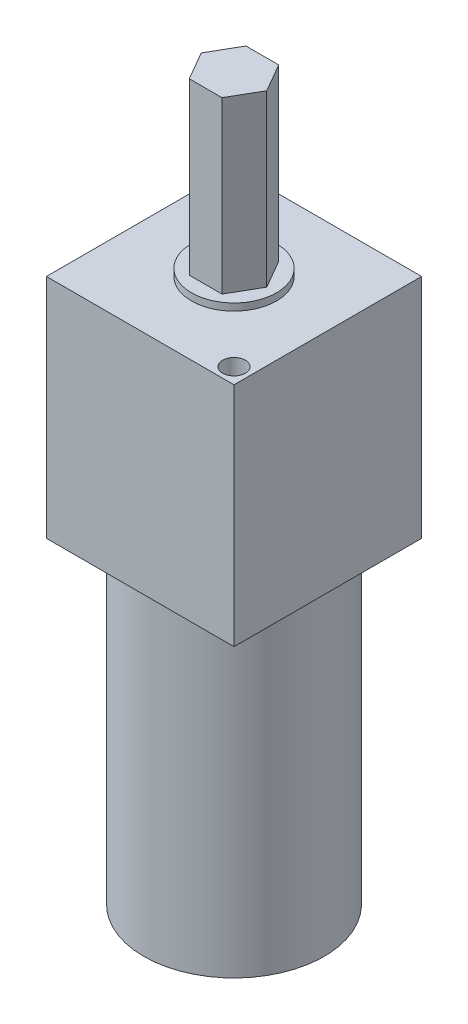
ISO-10303-21;
HEADER;
FILE_DESCRIPTION(('STEP AP214'),'2;1');
FILE_NAME('part.step','',(''),(''),'','','');
FILE_SCHEMA(('AUTOMOTIVE_DESIGN { 1 0 10303 214 1 1 1 1 }'));
ENDSEC;
DATA;
#1=APPLICATION_CONTEXT('core data for automotive mechanical design processes');
#2=APPLICATION_PROTOCOL_DEFINITION('international standard','automotive_design',2000,#1);
#3=PRODUCT_CONTEXT('',#1,'mechanical');
#4=PRODUCT('Part','Part','',(#3));
#5=PRODUCT_RELATED_PRODUCT_CATEGORY('part','',(#4));
#6=PRODUCT_DEFINITION_FORMATION('','',#4);
#7=PRODUCT_DEFINITION_CONTEXT('part definition',#1,'design');
#8=PRODUCT_DEFINITION('design','',#6,#7);
#9=PRODUCT_DEFINITION_SHAPE('','',#8);
#10=(LENGTH_UNIT() NAMED_UNIT(*) SI_UNIT(.MILLI.,.METRE.));
#11=(NAMED_UNIT(*) PLANE_ANGLE_UNIT() SI_UNIT($,.RADIAN.));
#12=(NAMED_UNIT(*) SI_UNIT($,.STERADIAN.) SOLID_ANGLE_UNIT());
#13=UNCERTAINTY_MEASURE_WITH_UNIT(LENGTH_MEASURE(1.E-05),#10,'distance_accuracy_value','');
#14=(GEOMETRIC_REPRESENTATION_CONTEXT(3) GLOBAL_UNCERTAINTY_ASSIGNED_CONTEXT((#13)) GLOBAL_UNIT_ASSIGNED_CONTEXT((#10,
#11,#12)) REPRESENTATION_CONTEXT('',''));
#15=CARTESIAN_POINT('',(0.,0.,0.));
#16=DIRECTION('',(0.,0.,1.));
#17=DIRECTION('',(1.,0.,0.));
#18=AXIS2_PLACEMENT_3D('',#15,#16,#17);
#19=CARTESIAN_POINT('',(0.,52.3875,0.));
#20=DIRECTION('',(0.,1.,0.));
#21=DIRECTION('',(0.,0.,1.));
#22=AXIS2_PLACEMENT_3D('',#19,#20,#21);
#23=PLANE('',#22);
#24=CARTESIAN_POINT('',(0.,52.3875,0.));
#25=DIRECTION('',(0.,1.,0.));
#26=DIRECTION('',(0.,0.,1.));
#27=AXIS2_PLACEMENT_3D('',#24,#25,#26);
#28=CIRCLE('',#27,9.525);
#29=CARTESIAN_POINT('',(0.,52.3875,9.525));
#30=VERTEX_POINT('',#29);
#31=EDGE_CURVE('E152',#30,#30,#28,.T.);
#32=ORIENTED_EDGE('',*,*,#31,.T.);
#33=EDGE_LOOP('',(#32));
#34=FACE_BOUND('',#33,.T.);
#35=DIRECTION('',(0.5,0.,-0.866025403784439));
#36=VECTOR('',#35,1.);
#37=CARTESIAN_POINT('',(3.66617420935412,52.3875,6.35));
#38=LINE('',#37,#36);
#39=CARTESIAN_POINT('',(3.66617420935412,52.3875,6.35));
#40=VERTEX_POINT('',#39);
#41=CARTESIAN_POINT('',(7.33234841870825,52.3875,0.));
#42=VERTEX_POINT('',#41);
#43=EDGE_CURVE('E405',#40,#42,#38,.T.);
#44=ORIENTED_EDGE('',*,*,#43,.F.);
#45=DIRECTION('',(1.,0.,0.));
#46=VECTOR('',#45,1.);
#47=CARTESIAN_POINT('',(-3.66617420935412,52.3875,6.35));
#48=LINE('',#47,#46);
#49=CARTESIAN_POINT('',(-3.66617420935412,52.3875,6.35));
#50=VERTEX_POINT('',#49);
#51=EDGE_CURVE('E147',#50,#40,#48,.T.);
#52=ORIENTED_EDGE('',*,*,#51,.F.);
#53=DIRECTION('',(0.5,0.,0.866025403784439));
#54=VECTOR('',#53,1.);
#55=CARTESIAN_POINT('',(-7.33234841870825,52.3875,0.));
#56=LINE('',#55,#54);
#57=CARTESIAN_POINT('',(-7.33234841870825,52.3875,0.));
#58=VERTEX_POINT('',#57);
#59=EDGE_CURVE('E143',#58,#50,#56,.T.);
#60=ORIENTED_EDGE('',*,*,#59,.F.);
#61=DIRECTION('',(-0.5,0.,0.866025403784438));
#62=VECTOR('',#61,1.);
#63=CARTESIAN_POINT('',(-3.66617420935413,52.3875,-6.35));
#64=LINE('',#63,#62);
#65=CARTESIAN_POINT('',(-3.66617420935413,52.3875,-6.35));
#66=VERTEX_POINT('',#65);
#67=EDGE_CURVE('E420',#66,#58,#64,.T.);
#68=ORIENTED_EDGE('',*,*,#67,.F.);
#69=DIRECTION('',(-1.,0.,0.));
#70=VECTOR('',#69,1.);
#71=CARTESIAN_POINT('',(3.66617420935412,52.3875,-6.35));
#72=LINE('',#71,#70);
#73=CARTESIAN_POINT('',(3.66617420935412,52.3875,-6.35));
#74=VERTEX_POINT('',#73);
#75=EDGE_CURVE('E418',#74,#66,#72,.T.);
#76=ORIENTED_EDGE('',*,*,#75,.F.);
#77=DIRECTION('',(-0.5,0.,-0.866025403784439));
#78=VECTOR('',#77,1.);
#79=CARTESIAN_POINT('',(7.33234841870825,52.3875,0.));
#80=LINE('',#79,#78);
#81=EDGE_CURVE('E416',#42,#74,#80,.T.);
#82=ORIENTED_EDGE('',*,*,#81,.F.);
#83=EDGE_LOOP('',(#44,#52,#60,#68,#76,#82));
#84=FACE_BOUND('',#83,.T.);
#85=ADVANCED_FACE('F37',(#34,#84),#23,.T.);
#86=CARTESIAN_POINT('',(0.,50.8,0.));
#87=DIRECTION('',(0.,1.,0.));
#88=DIRECTION('',(0.,0.,1.));
#89=AXIS2_PLACEMENT_3D('',#86,#87,#88);
#90=PLANE('',#89);
#91=CARTESIAN_POINT('',(0.,50.8,0.));
#92=DIRECTION('',(0.,1.,0.));
#93=DIRECTION('',(0.,0.,1.));
#94=AXIS2_PLACEMENT_3D('',#91,#92,#93);
#95=CIRCLE('',#94,9.525);
#96=CARTESIAN_POINT('',(0.,50.8,9.525));
#97=VERTEX_POINT('',#96);
#98=EDGE_CURVE('E149',#97,#97,#95,.T.);
#99=ORIENTED_EDGE('',*,*,#98,.F.);
#100=EDGE_LOOP('',(#99));
#101=FACE_BOUND('',#100,.T.);
#102=CARTESIAN_POINT('',(-17.5025191799638,50.8,-17.5025191799638));
#103=DIRECTION('',(0.,1.,0.));
#104=DIRECTION('',(0.,0.,1.));
#105=AXIS2_PLACEMENT_3D('',#102,#103,#104);
#106=CIRCLE('',#105,2.54);
#107=CARTESIAN_POINT('',(-17.5025191799638,50.8,-14.9625191799638));
#108=VERTEX_POINT('',#107);
#109=EDGE_CURVE('E167',#108,#108,#106,.T.);
#110=ORIENTED_EDGE('',*,*,#109,.F.);
#111=EDGE_LOOP('',(#110));
#112=FACE_BOUND('',#111,.T.);
#113=DIRECTION('',(0.,0.,-1.));
#114=VECTOR('',#113,1.);
#115=CARTESIAN_POINT('',(21.0058,50.8,-21.0058));
#116=LINE('',#115,#114);
#117=CARTESIAN_POINT('',(21.0058,50.8,21.0058));
#118=VERTEX_POINT('',#117);
#119=CARTESIAN_POINT('',(21.0058,50.8,-21.0058));
#120=VERTEX_POINT('',#119);
#121=EDGE_CURVE('E173',#118,#120,#116,.T.);
#122=ORIENTED_EDGE('',*,*,#121,.T.);
#123=DIRECTION('',(-1.,0.,0.));
#124=VECTOR('',#123,1.);
#125=CARTESIAN_POINT('',(-21.0058,50.8,-21.0058));
#126=LINE('',#125,#124);
#127=CARTESIAN_POINT('',(-21.0058,50.8,-21.0058));
#128=VERTEX_POINT('',#127);
#129=EDGE_CURVE('E90',#120,#128,#126,.T.);
#130=ORIENTED_EDGE('',*,*,#129,.T.);
#131=DIRECTION('',(0.,0.,1.));
#132=VECTOR('',#131,1.);
#133=CARTESIAN_POINT('',(-21.0058,50.8,-21.0058));
#134=LINE('',#133,#132);
#135=CARTESIAN_POINT('',(-21.0058,50.8,21.0058));
#136=VERTEX_POINT('',#135);
#137=EDGE_CURVE('E176',#128,#136,#134,.T.);
#138=ORIENTED_EDGE('',*,*,#137,.T.);
#139=DIRECTION('',(1.,0.,0.));
#140=VECTOR('',#139,1.);
#141=CARTESIAN_POINT('',(-21.0058,50.8,21.0058));
#142=LINE('',#141,#140);
#143=EDGE_CURVE('E61',#136,#118,#142,.T.);
#144=ORIENTED_EDGE('',*,*,#143,.T.);
#145=EDGE_LOOP('',(#122,#130,#138,#144));
#146=FACE_BOUND('',#145,.T.);
#147=CARTESIAN_POINT('',(17.5025191799638,50.8,17.5025191799638));
#148=DIRECTION('',(0.,1.,0.));
#149=DIRECTION('',(0.,0.,1.));
#150=AXIS2_PLACEMENT_3D('',#147,#148,#149);
#151=CIRCLE('',#150,2.54);
#152=CARTESIAN_POINT('',(17.5025191799638,50.8,20.0425191799638));
#153=VERTEX_POINT('',#152);
#154=EDGE_CURVE('E161',#153,#153,#151,.T.);
#155=ORIENTED_EDGE('',*,*,#154,.F.);
#156=EDGE_LOOP('',(#155));
#157=FACE_BOUND('',#156,.T.);
#158=ADVANCED_FACE('F206',(#101,#112,#146,#157),#90,.T.);
#159=CARTESIAN_POINT('',(0.,0.,0.));
#160=DIRECTION('',(0.,1.,0.));
#161=DIRECTION('',(0.,0.,1.));
#162=AXIS2_PLACEMENT_3D('',#159,#160,#161);
#163=PLANE('',#162);
#164=CARTESIAN_POINT('',(0.,0.,0.));
#165=DIRECTION('',(0.,1.,0.));
#166=DIRECTION('',(0.,0.,1.));
#167=AXIS2_PLACEMENT_3D('',#164,#165,#166);
#168=CIRCLE('',#167,20.193);
#169=CARTESIAN_POINT('',(0.,0.,20.193));
#170=VERTEX_POINT('',#169);
#171=EDGE_CURVE('E11',#170,#170,#168,.F.);
#172=ORIENTED_EDGE('',*,*,#171,.F.);
#173=EDGE_LOOP('',(#172));
#174=FACE_BOUND('',#173,.T.);
#175=DIRECTION('',(0.,0.,-1.));
#176=VECTOR('',#175,1.);
#177=CARTESIAN_POINT('',(21.0058,0.,-21.0058));
#178=LINE('',#177,#176);
#179=CARTESIAN_POINT('',(21.0058,0.,21.0058));
#180=VERTEX_POINT('',#179);
#181=CARTESIAN_POINT('',(21.0058,0.,-21.0058));
#182=VERTEX_POINT('',#181);
#183=EDGE_CURVE('E170',#180,#182,#178,.T.);
#184=ORIENTED_EDGE('',*,*,#183,.F.);
#185=DIRECTION('',(1.,0.,0.));
#186=VECTOR('',#185,1.);
#187=CARTESIAN_POINT('',(-21.0058,0.,21.0058));
#188=LINE('',#187,#186);
#189=CARTESIAN_POINT('',(-21.0058,0.,21.0058));
#190=VERTEX_POINT('',#189);
#191=EDGE_CURVE('E82',#190,#180,#188,.T.);
#192=ORIENTED_EDGE('',*,*,#191,.F.);
#193=DIRECTION('',(0.,0.,1.));
#194=VECTOR('',#193,1.);
#195=CARTESIAN_POINT('',(-21.0058,0.,-21.0058));
#196=LINE('',#195,#194);
#197=CARTESIAN_POINT('',(-21.0058,0.,-21.0058));
#198=VERTEX_POINT('',#197);
#199=EDGE_CURVE('E184',#198,#190,#196,.T.);
#200=ORIENTED_EDGE('',*,*,#199,.F.);
#201=DIRECTION('',(-1.,0.,0.));
#202=VECTOR('',#201,1.);
#203=CARTESIAN_POINT('',(-21.0058,0.,-21.0058));
#204=LINE('',#203,#202);
#205=EDGE_CURVE('E182',#182,#198,#204,.T.);
#206=ORIENTED_EDGE('',*,*,#205,.F.);
#207=EDGE_LOOP('',(#184,#192,#200,#206));
#208=FACE_BOUND('',#207,.T.);
#209=CARTESIAN_POINT('',(-17.5025191799638,0.,-17.5025191799638));
#210=DIRECTION('',(0.,1.,0.));
#211=DIRECTION('',(0.,0.,1.));
#212=AXIS2_PLACEMENT_3D('',#209,#210,#211);
#213=CIRCLE('',#212,2.54);
#214=CARTESIAN_POINT('',(-17.5025191799638,0.,-14.9625191799638));
#215=VERTEX_POINT('',#214);
#216=EDGE_CURVE('E164',#215,#215,#213,.T.);
#217=ORIENTED_EDGE('',*,*,#216,.T.);
#218=EDGE_LOOP('',(#217));
#219=FACE_BOUND('',#218,.T.);
#220=CARTESIAN_POINT('',(17.5025191799638,0.,17.5025191799638));
#221=DIRECTION('',(0.,1.,0.));
#222=DIRECTION('',(0.,0.,1.));
#223=AXIS2_PLACEMENT_3D('',#220,#221,#222);
#224=CIRCLE('',#223,2.54);
#225=CARTESIAN_POINT('',(17.5025191799638,0.,20.0425191799638));
#226=VERTEX_POINT('',#225);
#227=EDGE_CURVE('E159',#226,#226,#224,.T.);
#228=ORIENTED_EDGE('',*,*,#227,.T.);
#229=EDGE_LOOP('',(#228));
#230=FACE_BOUND('',#229,.T.);
#231=ADVANCED_FACE('F198',(#174,#208,#219,#230),#163,.F.);
#232=CARTESIAN_POINT('',(21.0058,50.8,-21.0058));
#233=DIRECTION('',(-1.,0.,0.));
#234=DIRECTION('',(0.,0.,1.));
#235=AXIS2_PLACEMENT_3D('',#232,#233,#234);
#236=PLANE('',#235);
#237=ORIENTED_EDGE('',*,*,#183,.T.);
#238=DIRECTION('',(0.,-1.,0.));
#239=VECTOR('',#238,1.);
#240=CARTESIAN_POINT('',(21.0058,50.8,-21.0058));
#241=LINE('',#240,#239);
#242=EDGE_CURVE('E45',#120,#182,#241,.T.);
#243=ORIENTED_EDGE('',*,*,#242,.F.);
#244=ORIENTED_EDGE('',*,*,#121,.F.);
#245=DIRECTION('',(0.,-1.,0.));
#246=VECTOR('',#245,1.);
#247=CARTESIAN_POINT('',(21.0058,50.8,21.0058));
#248=LINE('',#247,#246);
#249=EDGE_CURVE('E179',#118,#180,#248,.T.);
#250=ORIENTED_EDGE('',*,*,#249,.T.);
#251=EDGE_LOOP('',(#237,#243,#244,#250));
#252=FACE_BOUND('',#251,.T.);
#253=ADVANCED_FACE('F39',(#252),#236,.F.);
#254=CARTESIAN_POINT('',(-21.0058,50.8,-21.0058));
#255=DIRECTION('',(0.,0.,1.));
#256=DIRECTION('',(1.,0.,0.));
#257=AXIS2_PLACEMENT_3D('',#254,#255,#256);
#258=PLANE('',#257);
#259=ORIENTED_EDGE('',*,*,#205,.T.);
#260=DIRECTION('',(0.,-1.,0.));
#261=VECTOR('',#260,1.);
#262=CARTESIAN_POINT('',(-21.0058,50.8,-21.0058));
#263=LINE('',#262,#261);
#264=EDGE_CURVE('E190',#128,#198,#263,.T.);
#265=ORIENTED_EDGE('',*,*,#264,.F.);
#266=ORIENTED_EDGE('',*,*,#129,.F.);
#267=ORIENTED_EDGE('',*,*,#242,.T.);
#268=EDGE_LOOP('',(#259,#265,#266,#267));
#269=FACE_BOUND('',#268,.T.);
#270=ADVANCED_FACE('F193',(#269),#258,.F.);
#271=CARTESIAN_POINT('',(-21.0058,50.8,-21.0058));
#272=DIRECTION('',(1.,0.,0.));
#273=DIRECTION('',(0.,0.,-1.));
#274=AXIS2_PLACEMENT_3D('',#271,#272,#273);
#275=PLANE('',#274);
#276=ORIENTED_EDGE('',*,*,#199,.T.);
#277=DIRECTION('',(0.,-1.,0.));
#278=VECTOR('',#277,1.);
#279=CARTESIAN_POINT('',(-21.0058,50.8,21.0058));
#280=LINE('',#279,#278);
#281=EDGE_CURVE('E188',#136,#190,#280,.T.);
#282=ORIENTED_EDGE('',*,*,#281,.F.);
#283=ORIENTED_EDGE('',*,*,#137,.F.);
#284=ORIENTED_EDGE('',*,*,#264,.T.);
#285=EDGE_LOOP('',(#276,#282,#283,#284));
#286=FACE_BOUND('',#285,.T.);
#287=ADVANCED_FACE('F203',(#286),#275,.F.);
#288=CARTESIAN_POINT('',(-21.0058,50.8,21.0058));
#289=DIRECTION('',(0.,0.,-1.));
#290=DIRECTION('',(-1.,0.,0.));
#291=AXIS2_PLACEMENT_3D('',#288,#289,#290);
#292=PLANE('',#291);
#293=ORIENTED_EDGE('',*,*,#191,.T.);
#294=ORIENTED_EDGE('',*,*,#249,.F.);
#295=ORIENTED_EDGE('',*,*,#143,.F.);
#296=ORIENTED_EDGE('',*,*,#281,.T.);
#297=EDGE_LOOP('',(#293,#294,#295,#296));
#298=FACE_BOUND('',#297,.T.);
#299=ADVANCED_FACE('F205',(#298),#292,.F.);
#300=CARTESIAN_POINT('',(-17.5025191799638,50.8,-17.5025191799638));
#301=DIRECTION('',(0.,-1.,0.));
#302=DIRECTION('',(0.,0.,-1.));
#303=AXIS2_PLACEMENT_3D('',#300,#301,#302);
#304=CYLINDRICAL_SURFACE('',#303,2.54);
#305=ORIENTED_EDGE('',*,*,#109,.T.);
#306=EDGE_LOOP('',(#305));
#307=FACE_BOUND('',#306,.T.);
#308=ORIENTED_EDGE('',*,*,#216,.F.);
#309=EDGE_LOOP('',(#308));
#310=FACE_BOUND('',#309,.T.);
#311=ADVANCED_FACE('F217',(#307,#310),#304,.F.);
#312=CARTESIAN_POINT('',(17.5025191799638,50.8,17.5025191799638));
#313=DIRECTION('',(0.,-1.,0.));
#314=DIRECTION('',(0.,0.,-1.));
#315=AXIS2_PLACEMENT_3D('',#312,#313,#314);
#316=CYLINDRICAL_SURFACE('',#315,2.54);
#317=ORIENTED_EDGE('',*,*,#154,.T.);
#318=EDGE_LOOP('',(#317));
#319=FACE_BOUND('',#318,.T.);
#320=ORIENTED_EDGE('',*,*,#227,.F.);
#321=EDGE_LOOP('',(#320));
#322=FACE_BOUND('',#321,.T.);
#323=ADVANCED_FACE('F213',(#319,#322),#316,.F.);
#324=CARTESIAN_POINT('',(0.,52.3875,0.));
#325=DIRECTION('',(0.,-1.,0.));
#326=DIRECTION('',(0.,0.,-1.));
#327=AXIS2_PLACEMENT_3D('',#324,#325,#326);
#328=CYLINDRICAL_SURFACE('',#327,9.525);
#329=ORIENTED_EDGE('',*,*,#31,.F.);
#330=EDGE_LOOP('',(#329));
#331=FACE_BOUND('',#330,.T.);
#332=ORIENTED_EDGE('',*,*,#98,.T.);
#333=EDGE_LOOP('',(#332));
#334=FACE_BOUND('',#333,.T.);
#335=ADVANCED_FACE('F216',(#331,#334),#328,.T.);
#336=CARTESIAN_POINT('',(-3.66617420935412,90.4875,6.35));
#337=DIRECTION('',(0.,0.,-1.));
#338=DIRECTION('',(-1.,0.,0.));
#339=AXIS2_PLACEMENT_3D('',#336,#337,#338);
#340=PLANE('',#339);
#341=ORIENTED_EDGE('',*,*,#51,.T.);
#342=DIRECTION('',(0.,-1.,0.));
#343=VECTOR('',#342,1.);
#344=CARTESIAN_POINT('',(3.66617420935412,90.4875,6.35));
#345=LINE('',#344,#343);
#346=CARTESIAN_POINT('',(3.66617420935412,90.4875,6.35));
#347=VERTEX_POINT('',#346);
#348=EDGE_CURVE('E128',#347,#40,#345,.T.);
#349=ORIENTED_EDGE('',*,*,#348,.F.);
#350=DIRECTION('',(1.,0.,0.));
#351=VECTOR('',#350,1.);
#352=CARTESIAN_POINT('',(-3.66617420935412,90.4875,6.35));
#353=LINE('',#352,#351);
#354=CARTESIAN_POINT('',(-3.66617420935412,90.4875,6.35));
#355=VERTEX_POINT('',#354);
#356=EDGE_CURVE('E135',#355,#347,#353,.T.);
#357=ORIENTED_EDGE('',*,*,#356,.F.);
#358=DIRECTION('',(0.,-1.,0.));
#359=VECTOR('',#358,1.);
#360=CARTESIAN_POINT('',(-3.66617420935412,90.4875,6.35));
#361=LINE('',#360,#359);
#362=EDGE_CURVE('E413',#355,#50,#361,.T.);
#363=ORIENTED_EDGE('',*,*,#362,.T.);
#364=EDGE_LOOP('',(#341,#349,#357,#363));
#365=FACE_BOUND('',#364,.T.);
#366=ADVANCED_FACE('F145',(#365),#340,.F.);
#367=CARTESIAN_POINT('',(3.66617420935412,90.4875,6.35));
#368=DIRECTION('',(-0.866025403784438,0.,-0.5));
#369=DIRECTION('',(-0.5,0.,0.866025403784438));
#370=AXIS2_PLACEMENT_3D('',#367,#368,#369);
#371=PLANE('',#370);
#372=ORIENTED_EDGE('',*,*,#43,.T.);
#373=DIRECTION('',(0.,-1.,0.));
#374=VECTOR('',#373,1.);
#375=CARTESIAN_POINT('',(7.33234841870825,90.4875,0.));
#376=LINE('',#375,#374);
#377=CARTESIAN_POINT('',(7.33234841870825,90.4875,0.));
#378=VERTEX_POINT('',#377);
#379=EDGE_CURVE('E131',#378,#42,#376,.T.);
#380=ORIENTED_EDGE('',*,*,#379,.F.);
#381=DIRECTION('',(0.5,0.,-0.866025403784439));
#382=VECTOR('',#381,1.);
#383=CARTESIAN_POINT('',(3.66617420935412,90.4875,6.35));
#384=LINE('',#383,#382);
#385=EDGE_CURVE('E124',#347,#378,#384,.T.);
#386=ORIENTED_EDGE('',*,*,#385,.F.);
#387=ORIENTED_EDGE('',*,*,#348,.T.);
#388=EDGE_LOOP('',(#372,#380,#386,#387));
#389=FACE_BOUND('',#388,.T.);
#390=ADVANCED_FACE('F126',(#389),#371,.F.);
#391=CARTESIAN_POINT('',(7.33234841870825,90.4875,0.));
#392=DIRECTION('',(-0.866025403784439,0.,0.5));
#393=DIRECTION('',(0.5,0.,0.866025403784439));
#394=AXIS2_PLACEMENT_3D('',#391,#392,#393);
#395=PLANE('',#394);
#396=ORIENTED_EDGE('',*,*,#81,.T.);
#397=DIRECTION('',(0.,-1.,0.));
#398=VECTOR('',#397,1.);
#399=CARTESIAN_POINT('',(3.66617420935412,90.4875,-6.35));
#400=LINE('',#399,#398);
#401=CARTESIAN_POINT('',(3.66617420935412,90.4875,-6.35));
#402=VERTEX_POINT('',#401);
#403=EDGE_CURVE('E154',#402,#74,#400,.T.);
#404=ORIENTED_EDGE('',*,*,#403,.F.);
#405=DIRECTION('',(-0.5,0.,-0.866025403784439));
#406=VECTOR('',#405,1.);
#407=CARTESIAN_POINT('',(7.33234841870825,90.4875,0.));
#408=LINE('',#407,#406);
#409=EDGE_CURVE('E134',#378,#402,#408,.T.);
#410=ORIENTED_EDGE('',*,*,#409,.F.);
#411=ORIENTED_EDGE('',*,*,#379,.T.);
#412=EDGE_LOOP('',(#396,#404,#410,#411));
#413=FACE_BOUND('',#412,.T.);
#414=ADVANCED_FACE('F313',(#413),#395,.F.);
#415=CARTESIAN_POINT('',(3.66617420935412,90.4875,-6.35));
#416=DIRECTION('',(0.,0.,1.));
#417=DIRECTION('',(1.,0.,0.));
#418=AXIS2_PLACEMENT_3D('',#415,#416,#417);
#419=PLANE('',#418);
#420=ORIENTED_EDGE('',*,*,#75,.T.);
#421=DIRECTION('',(0.,-1.,0.));
#422=VECTOR('',#421,1.);
#423=CARTESIAN_POINT('',(-3.66617420935413,90.4875,-6.35));
#424=LINE('',#423,#422);
#425=CARTESIAN_POINT('',(-3.66617420935413,90.4875,-6.35));
#426=VERTEX_POINT('',#425);
#427=EDGE_CURVE('E425',#426,#66,#424,.T.);
#428=ORIENTED_EDGE('',*,*,#427,.F.);
#429=DIRECTION('',(-1.,0.,0.));
#430=VECTOR('',#429,1.);
#431=CARTESIAN_POINT('',(3.66617420935412,90.4875,-6.35));
#432=LINE('',#431,#430);
#433=EDGE_CURVE('E409',#402,#426,#432,.T.);
#434=ORIENTED_EDGE('',*,*,#433,.F.);
#435=ORIENTED_EDGE('',*,*,#403,.T.);
#436=EDGE_LOOP('',(#420,#428,#434,#435));
#437=FACE_BOUND('',#436,.T.);
#438=ADVANCED_FACE('F322',(#437),#419,.F.);
#439=CARTESIAN_POINT('',(-3.66617420935413,90.4875,-6.35));
#440=DIRECTION('',(0.866025403784439,0.,0.5));
#441=DIRECTION('',(0.5,0.,-0.866025403784438));
#442=AXIS2_PLACEMENT_3D('',#439,#440,#441);
#443=PLANE('',#442);
#444=ORIENTED_EDGE('',*,*,#67,.T.);
#445=DIRECTION('',(0.,-1.,0.));
#446=VECTOR('',#445,1.);
#447=CARTESIAN_POINT('',(-7.33234841870825,90.4875,0.));
#448=LINE('',#447,#446);
#449=CARTESIAN_POINT('',(-7.33234841870825,90.4875,0.));
#450=VERTEX_POINT('',#449);
#451=EDGE_CURVE('E52',#450,#58,#448,.T.);
#452=ORIENTED_EDGE('',*,*,#451,.F.);
#453=DIRECTION('',(-0.5,0.,0.866025403784438));
#454=VECTOR('',#453,1.);
#455=CARTESIAN_POINT('',(-3.66617420935413,90.4875,-6.35));
#456=LINE('',#455,#454);
#457=EDGE_CURVE('E411',#426,#450,#456,.T.);
#458=ORIENTED_EDGE('',*,*,#457,.F.);
#459=ORIENTED_EDGE('',*,*,#427,.T.);
#460=EDGE_LOOP('',(#444,#452,#458,#459));
#461=FACE_BOUND('',#460,.T.);
#462=ADVANCED_FACE('F333',(#461),#443,.F.);
#463=CARTESIAN_POINT('',(-7.33234841870825,90.4875,0.));
#464=DIRECTION('',(0.866025403784439,0.,-0.5));
#465=DIRECTION('',(-0.5,0.,-0.866025403784439));
#466=AXIS2_PLACEMENT_3D('',#463,#464,#465);
#467=PLANE('',#466);
#468=ORIENTED_EDGE('',*,*,#59,.T.);
#469=ORIENTED_EDGE('',*,*,#362,.F.);
#470=DIRECTION('',(0.5,0.,0.866025403784439));
#471=VECTOR('',#470,1.);
#472=CARTESIAN_POINT('',(-7.33234841870825,90.4875,0.));
#473=LINE('',#472,#471);
#474=EDGE_CURVE('E139',#450,#355,#473,.T.);
#475=ORIENTED_EDGE('',*,*,#474,.F.);
#476=ORIENTED_EDGE('',*,*,#451,.T.);
#477=EDGE_LOOP('',(#468,#469,#475,#476));
#478=FACE_BOUND('',#477,.T.);
#479=ADVANCED_FACE('F345',(#478),#467,.F.);
#480=CARTESIAN_POINT('',(0.,90.4875,0.));
#481=DIRECTION('',(0.,1.,0.));
#482=DIRECTION('',(0.,0.,1.));
#483=AXIS2_PLACEMENT_3D('',#480,#481,#482);
#484=PLANE('',#483);
#485=ORIENTED_EDGE('',*,*,#356,.T.);
#486=ORIENTED_EDGE('',*,*,#385,.T.);
#487=ORIENTED_EDGE('',*,*,#409,.T.);
#488=ORIENTED_EDGE('',*,*,#433,.T.);
#489=ORIENTED_EDGE('',*,*,#457,.T.);
#490=ORIENTED_EDGE('',*,*,#474,.T.);
#491=EDGE_LOOP('',(#485,#486,#487,#488,#489,#490));
#492=FACE_BOUND('',#491,.T.);
#493=ADVANCED_FACE('F138',(#492),#484,.T.);
#494=CARTESIAN_POINT('',(0.,-70.993,0.));
#495=DIRECTION('',(0.,1.,0.));
#496=DIRECTION('',(0.,0.,1.));
#497=AXIS2_PLACEMENT_3D('',#494,#495,#496);
#498=CYLINDRICAL_SURFACE('',#497,20.193);
#499=CARTESIAN_POINT('',(0.,-70.993,0.));
#500=DIRECTION('',(0.,-1.,0.));
#501=DIRECTION('',(0.,0.,-1.));
#502=AXIS2_PLACEMENT_3D('',#499,#500,#501);
#503=CIRCLE('',#502,20.193);
#504=CARTESIAN_POINT('',(0.,-70.993,-20.193));
#505=VERTEX_POINT('',#504);
#506=EDGE_CURVE('E403',#505,#505,#503,.T.);
#507=ORIENTED_EDGE('',*,*,#506,.F.);
#508=EDGE_LOOP('',(#507));
#509=FACE_BOUND('',#508,.T.);
#510=ORIENTED_EDGE('',*,*,#171,.T.);
#511=EDGE_LOOP('',(#510));
#512=FACE_BOUND('',#511,.T.);
#513=ADVANCED_FACE('F363',(#509,#512),#498,.T.);
#514=CARTESIAN_POINT('',(0.,-70.993,0.));
#515=DIRECTION('',(0.,-1.,0.));
#516=DIRECTION('',(0.,0.,-1.));
#517=AXIS2_PLACEMENT_3D('',#514,#515,#516);
#518=PLANE('',#517);
#519=ORIENTED_EDGE('',*,*,#506,.T.);
#520=EDGE_LOOP('',(#519));
#521=FACE_BOUND('',#520,.T.);
#522=ADVANCED_FACE('F378',(#521),#518,.T.);
#523=CLOSED_SHELL('',(#85,#158,#231,#253,#270,#287,#299,#311,#323,#335,#366,#390,#414,#438,#462,
#479,#493,#513,#522));
#524=MANIFOLD_SOLID_BREP('B2',#523);
#525=ADVANCED_BREP_SHAPE_REPRESENTATION('',(#18,#524),#14);
#526=SHAPE_DEFINITION_REPRESENTATION(#9,#525);
ENDSEC;
END-ISO-10303-21;
